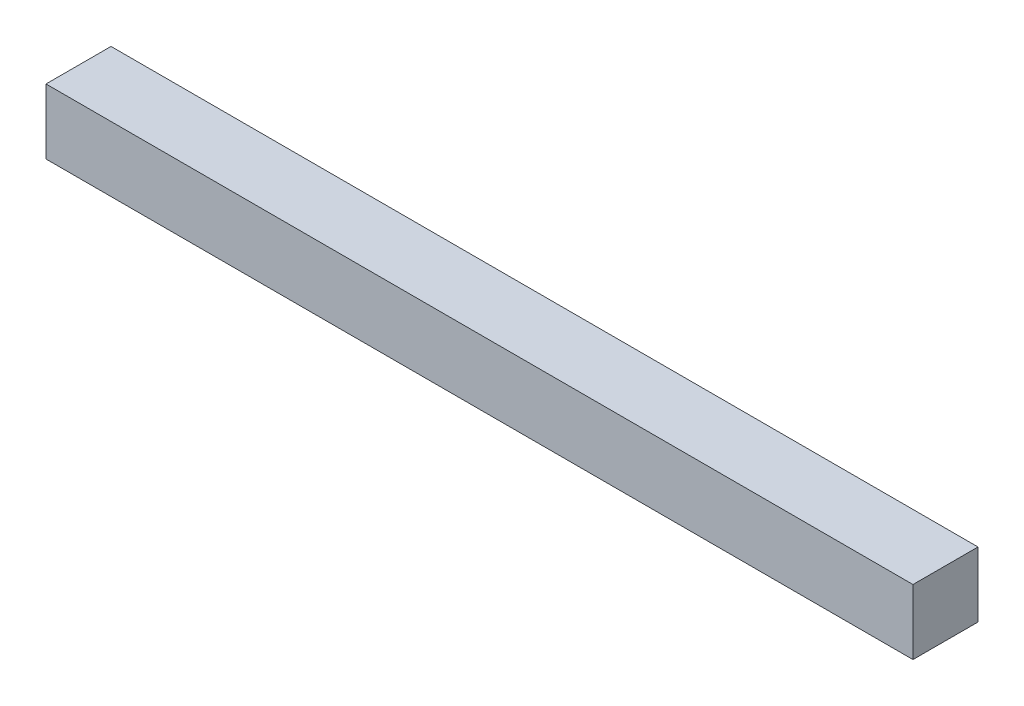
ISO-10303-21;
HEADER;
FILE_DESCRIPTION(('STEP AP214'),'2;1');
FILE_NAME('part.step','',(''),(''),'','','');
FILE_SCHEMA(('AUTOMOTIVE_DESIGN { 1 0 10303 214 1 1 1 1 }'));
ENDSEC;
DATA;
#1=APPLICATION_CONTEXT('core data for automotive mechanical design processes');
#2=APPLICATION_PROTOCOL_DEFINITION('international standard','automotive_design',2000,#1);
#3=PRODUCT_CONTEXT('',#1,'mechanical');
#4=PRODUCT('Part','Part','',(#3));
#5=PRODUCT_RELATED_PRODUCT_CATEGORY('part','',(#4));
#6=PRODUCT_DEFINITION_FORMATION('','',#4);
#7=PRODUCT_DEFINITION_CONTEXT('part definition',#1,'design');
#8=PRODUCT_DEFINITION('design','',#6,#7);
#9=PRODUCT_DEFINITION_SHAPE('','',#8);
#10=(LENGTH_UNIT() NAMED_UNIT(*) SI_UNIT(.MILLI.,.METRE.));
#11=(NAMED_UNIT(*) PLANE_ANGLE_UNIT() SI_UNIT($,.RADIAN.));
#12=(NAMED_UNIT(*) SI_UNIT($,.STERADIAN.) SOLID_ANGLE_UNIT());
#13=UNCERTAINTY_MEASURE_WITH_UNIT(LENGTH_MEASURE(1.E-05),#10,'distance_accuracy_value','');
#14=(GEOMETRIC_REPRESENTATION_CONTEXT(3) GLOBAL_UNCERTAINTY_ASSIGNED_CONTEXT((#13)) GLOBAL_UNIT_ASSIGNED_CONTEXT((#10,
#11,#12)) REPRESENTATION_CONTEXT('',''));
#15=CARTESIAN_POINT('',(0.,0.,0.));
#16=DIRECTION('',(0.,0.,1.));
#17=DIRECTION('',(1.,0.,0.));
#18=AXIS2_PLACEMENT_3D('',#15,#16,#17);
#19=CARTESIAN_POINT('',(63.5,2.38125000000001,-2.38125));
#20=DIRECTION('',(0.,0.,1.));
#21=DIRECTION('',(0.,-1.,0.));
#22=AXIS2_PLACEMENT_3D('',#19,#20,#21);
#23=PLANE('',#22);
#24=DIRECTION('',(0.,1.,0.));
#25=VECTOR('',#24,1.);
#26=CARTESIAN_POINT('',(0.,2.38125000000001,-2.38125));
#27=LINE('',#26,#25);
#28=CARTESIAN_POINT('',(0.,-2.38124999999999,-2.38125000000001));
#29=VERTEX_POINT('',#28);
#30=CARTESIAN_POINT('',(0.,2.38125000000001,-2.38125));
#31=VERTEX_POINT('',#30);
#32=EDGE_CURVE('E101',#29,#31,#27,.T.);
#33=ORIENTED_EDGE('',*,*,#32,.T.);
#34=DIRECTION('',(-1.,0.,0.));
#35=VECTOR('',#34,1.);
#36=CARTESIAN_POINT('',(63.5,2.38125000000001,-2.38125));
#37=LINE('',#36,#35);
#38=CARTESIAN_POINT('',(63.5,2.38125000000001,-2.38125));
#39=VERTEX_POINT('',#38);
#40=EDGE_CURVE('E11',#39,#31,#37,.T.);
#41=ORIENTED_EDGE('',*,*,#40,.F.);
#42=DIRECTION('',(0.,1.,0.));
#43=VECTOR('',#42,1.);
#44=CARTESIAN_POINT('',(63.5,2.38125000000001,-2.38125));
#45=LINE('',#44,#43);
#46=CARTESIAN_POINT('',(63.5,-2.38124999999999,-2.38125000000001));
#47=VERTEX_POINT('',#46);
#48=EDGE_CURVE('E89',#47,#39,#45,.T.);
#49=ORIENTED_EDGE('',*,*,#48,.F.);
#50=DIRECTION('',(-1.,0.,0.));
#51=VECTOR('',#50,1.);
#52=CARTESIAN_POINT('',(63.5,-2.38124999999999,-2.38125000000001));
#53=LINE('',#52,#51);
#54=EDGE_CURVE('E97',#47,#29,#53,.T.);
#55=ORIENTED_EDGE('',*,*,#54,.T.);
#56=EDGE_LOOP('',(#33,#41,#49,#55));
#57=FACE_BOUND('',#56,.T.);
#58=ADVANCED_FACE('F38',(#57),#23,.F.);
#59=CARTESIAN_POINT('',(63.5,2.38125000000001,2.38125));
#60=DIRECTION('',(0.,-1.,0.));
#61=DIRECTION('',(0.,0.,-1.));
#62=AXIS2_PLACEMENT_3D('',#59,#60,#61);
#63=PLANE('',#62);
#64=DIRECTION('',(0.,0.,1.));
#65=VECTOR('',#64,1.);
#66=CARTESIAN_POINT('',(0.,2.38125000000001,2.38125));
#67=LINE('',#66,#65);
#68=CARTESIAN_POINT('',(0.,2.38125000000001,2.38125));
#69=VERTEX_POINT('',#68);
#70=EDGE_CURVE('E93',#31,#69,#67,.T.);
#71=ORIENTED_EDGE('',*,*,#70,.T.);
#72=DIRECTION('',(-1.,0.,0.));
#73=VECTOR('',#72,1.);
#74=CARTESIAN_POINT('',(63.5,2.38125000000001,2.38125));
#75=LINE('',#74,#73);
#76=CARTESIAN_POINT('',(63.5,2.38125000000001,2.38125));
#77=VERTEX_POINT('',#76);
#78=EDGE_CURVE('E46',#77,#69,#75,.T.);
#79=ORIENTED_EDGE('',*,*,#78,.F.);
#80=DIRECTION('',(0.,0.,1.));
#81=VECTOR('',#80,1.);
#82=CARTESIAN_POINT('',(63.5,2.38125000000001,2.38125));
#83=LINE('',#82,#81);
#84=EDGE_CURVE('E84',#39,#77,#83,.T.);
#85=ORIENTED_EDGE('',*,*,#84,.F.);
#86=ORIENTED_EDGE('',*,*,#40,.T.);
#87=EDGE_LOOP('',(#71,#79,#85,#86));
#88=FACE_BOUND('',#87,.T.);
#89=ADVANCED_FACE('F92',(#88),#63,.F.);
#90=CARTESIAN_POINT('',(63.5,2.38125000000001,2.38125));
#91=DIRECTION('',(0.,0.,-1.));
#92=DIRECTION('',(0.,1.,0.));
#93=AXIS2_PLACEMENT_3D('',#90,#91,#92);
#94=PLANE('',#93);
#95=DIRECTION('',(0.,-1.,0.));
#96=VECTOR('',#95,1.);
#97=CARTESIAN_POINT('',(0.,2.38125000000001,2.38125));
#98=LINE('',#97,#96);
#99=CARTESIAN_POINT('',(0.,-2.38124999999999,2.38124999999999));
#100=VERTEX_POINT('',#99);
#101=EDGE_CURVE('E71',#69,#100,#98,.T.);
#102=ORIENTED_EDGE('',*,*,#101,.T.);
#103=DIRECTION('',(-1.,0.,0.));
#104=VECTOR('',#103,1.);
#105=CARTESIAN_POINT('',(63.5,-2.38124999999999,2.38124999999999));
#106=LINE('',#105,#104);
#107=CARTESIAN_POINT('',(63.5,-2.38124999999999,2.38124999999999));
#108=VERTEX_POINT('',#107);
#109=EDGE_CURVE('E94',#108,#100,#106,.T.);
#110=ORIENTED_EDGE('',*,*,#109,.F.);
#111=DIRECTION('',(0.,-1.,0.));
#112=VECTOR('',#111,1.);
#113=CARTESIAN_POINT('',(63.5,2.38125000000001,2.38125));
#114=LINE('',#113,#112);
#115=EDGE_CURVE('E87',#77,#108,#114,.T.);
#116=ORIENTED_EDGE('',*,*,#115,.F.);
#117=ORIENTED_EDGE('',*,*,#78,.T.);
#118=EDGE_LOOP('',(#102,#110,#116,#117));
#119=FACE_BOUND('',#118,.T.);
#120=ADVANCED_FACE('F95',(#119),#94,.F.);
#121=CARTESIAN_POINT('',(63.5,-2.38124999999999,2.38124999999999));
#122=DIRECTION('',(0.,1.,0.));
#123=DIRECTION('',(0.,0.,1.));
#124=AXIS2_PLACEMENT_3D('',#121,#122,#123);
#125=PLANE('',#124);
#126=DIRECTION('',(0.,0.,-1.));
#127=VECTOR('',#126,1.);
#128=CARTESIAN_POINT('',(0.,-2.38124999999999,2.38124999999999));
#129=LINE('',#128,#127);
#130=EDGE_CURVE('E77',#100,#29,#129,.T.);
#131=ORIENTED_EDGE('',*,*,#130,.T.);
#132=ORIENTED_EDGE('',*,*,#54,.F.);
#133=DIRECTION('',(0.,0.,-1.));
#134=VECTOR('',#133,1.);
#135=CARTESIAN_POINT('',(63.5,-2.38124999999999,2.38124999999999));
#136=LINE('',#135,#134);
#137=EDGE_CURVE('E54',#108,#47,#136,.T.);
#138=ORIENTED_EDGE('',*,*,#137,.F.);
#139=ORIENTED_EDGE('',*,*,#109,.T.);
#140=EDGE_LOOP('',(#131,#132,#138,#139));
#141=FACE_BOUND('',#140,.T.);
#142=ADVANCED_FACE('F108',(#141),#125,.F.);
#143=CARTESIAN_POINT('',(63.5,-2.38124999999999,-2.38125));
#144=DIRECTION('',(1.,0.,0.));
#145=DIRECTION('',(0.,0.,-1.));
#146=AXIS2_PLACEMENT_3D('',#143,#144,#145);
#147=PLANE('',#146);
#148=ORIENTED_EDGE('',*,*,#48,.T.);
#149=ORIENTED_EDGE('',*,*,#84,.T.);
#150=ORIENTED_EDGE('',*,*,#115,.T.);
#151=ORIENTED_EDGE('',*,*,#137,.T.);
#152=EDGE_LOOP('',(#148,#149,#150,#151));
#153=FACE_BOUND('',#152,.T.);
#154=ADVANCED_FACE('F85',(#153),#147,.T.);
#155=CARTESIAN_POINT('',(0.,-2.38124999999999,-2.38125));
#156=DIRECTION('',(1.,0.,0.));
#157=DIRECTION('',(0.,0.,-1.));
#158=AXIS2_PLACEMENT_3D('',#155,#156,#157);
#159=PLANE('',#158);
#160=ORIENTED_EDGE('',*,*,#32,.F.);
#161=ORIENTED_EDGE('',*,*,#130,.F.);
#162=ORIENTED_EDGE('',*,*,#101,.F.);
#163=ORIENTED_EDGE('',*,*,#70,.F.);
#164=EDGE_LOOP('',(#160,#161,#162,#163));
#165=FACE_BOUND('',#164,.T.);
#166=ADVANCED_FACE('F111',(#165),#159,.F.);
#167=CLOSED_SHELL('',(#58,#89,#120,#142,#154,#166));
#168=MANIFOLD_SOLID_BREP('B2',#167);
#169=ADVANCED_BREP_SHAPE_REPRESENTATION('',(#18,#168),#14);
#170=SHAPE_DEFINITION_REPRESENTATION(#9,#169);
ENDSEC;
END-ISO-10303-21;
